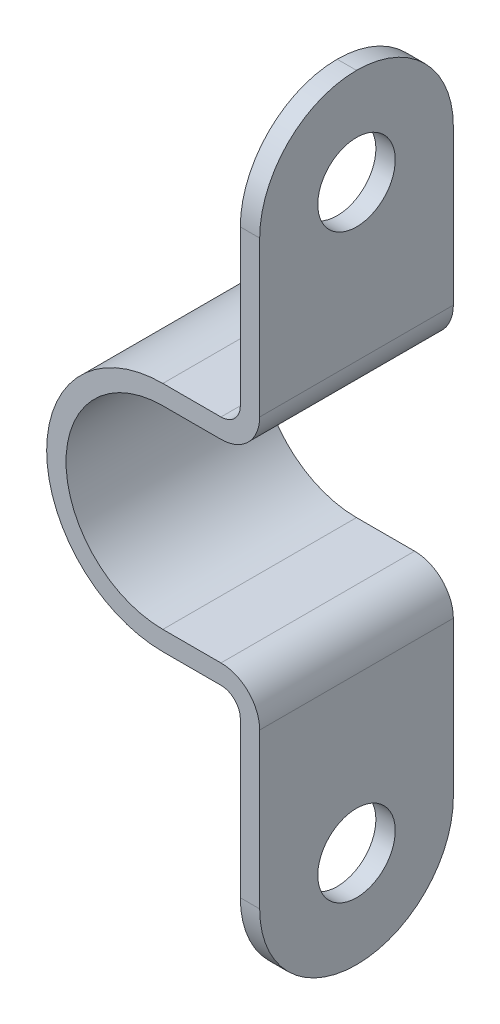
ISO-10303-21;
HEADER;
FILE_DESCRIPTION(('STEP AP214'),'2;1');
FILE_NAME('part.step','',(''),(''),'','','');
FILE_SCHEMA(('AUTOMOTIVE_DESIGN { 1 0 10303 214 1 1 1 1 }'));
ENDSEC;
DATA;
#1=APPLICATION_CONTEXT('core data for automotive mechanical design processes');
#2=APPLICATION_PROTOCOL_DEFINITION('international standard','automotive_design',2000,#1);
#3=PRODUCT_CONTEXT('',#1,'mechanical');
#4=PRODUCT('Part','Part','',(#3));
#5=PRODUCT_RELATED_PRODUCT_CATEGORY('part','',(#4));
#6=PRODUCT_DEFINITION_FORMATION('','',#4);
#7=PRODUCT_DEFINITION_CONTEXT('part definition',#1,'design');
#8=PRODUCT_DEFINITION('design','',#6,#7);
#9=PRODUCT_DEFINITION_SHAPE('','',#8);
#10=(LENGTH_UNIT() NAMED_UNIT(*) SI_UNIT(.MILLI.,.METRE.));
#11=(NAMED_UNIT(*) PLANE_ANGLE_UNIT() SI_UNIT($,.RADIAN.));
#12=(NAMED_UNIT(*) SI_UNIT($,.STERADIAN.) SOLID_ANGLE_UNIT());
#13=UNCERTAINTY_MEASURE_WITH_UNIT(LENGTH_MEASURE(1.E-05),#10,'distance_accuracy_value','');
#14=(GEOMETRIC_REPRESENTATION_CONTEXT(3) GLOBAL_UNCERTAINTY_ASSIGNED_CONTEXT((#13)) GLOBAL_UNIT_ASSIGNED_CONTEXT((#10,
#11,#12)) REPRESENTATION_CONTEXT('',''));
#15=CARTESIAN_POINT('',(0.,0.,0.));
#16=DIRECTION('',(0.,0.,1.));
#17=DIRECTION('',(1.,0.,0.));
#18=AXIS2_PLACEMENT_3D('',#15,#16,#17);
#19=CARTESIAN_POINT('',(4.,-7.00000000000002,10.));
#20=DIRECTION('',(1.,0.,0.));
#21=DIRECTION('',(0.,1.,0.));
#22=AXIS2_PLACEMENT_3D('',#19,#20,#21);
#23=PLANE('',#22);
#24=CARTESIAN_POINT('',(4.,-15.,5.));
#25=DIRECTION('',(-1.,0.,0.));
#26=DIRECTION('',(0.,-1.,0.));
#27=AXIS2_PLACEMENT_3D('',#24,#25,#26);
#28=CIRCLE('',#27,2.);
#29=CARTESIAN_POINT('',(4.,-17.,5.));
#30=VERTEX_POINT('',#29);
#31=EDGE_CURVE('E300',#30,#30,#28,.T.);
#32=ORIENTED_EDGE('',*,*,#31,.F.);
#33=EDGE_LOOP('',(#32));
#34=FACE_BOUND('',#33,.T.);
#35=CARTESIAN_POINT('',(4.,-15.,5.));
#36=DIRECTION('',(1.,0.,0.));
#37=DIRECTION('',(0.,1.,0.));
#38=AXIS2_PLACEMENT_3D('',#35,#36,#37);
#39=CIRCLE('',#38,5.);
#40=CARTESIAN_POINT('',(4.,-15.,0.));
#41=VERTEX_POINT('',#40);
#42=CARTESIAN_POINT('',(4.,-20.,5.));
#43=VERTEX_POINT('',#42);
#44=EDGE_CURVE('E57',#41,#43,#39,.F.);
#45=ORIENTED_EDGE('',*,*,#44,.T.);
#46=CARTESIAN_POINT('',(4.,-15.,5.));
#47=DIRECTION('',(1.,0.,0.));
#48=DIRECTION('',(0.,1.,0.));
#49=AXIS2_PLACEMENT_3D('',#46,#47,#48);
#50=CIRCLE('',#49,5.);
#51=CARTESIAN_POINT('',(4.,-15.,10.));
#52=VERTEX_POINT('',#51);
#53=EDGE_CURVE('E289',#43,#52,#50,.F.);
#54=ORIENTED_EDGE('',*,*,#53,.T.);
#55=DIRECTION('',(0.,-1.,0.));
#56=VECTOR('',#55,1.);
#57=CARTESIAN_POINT('',(4.,-7.00000000000002,10.));
#58=LINE('',#57,#56);
#59=CARTESIAN_POINT('',(4.,-7.00000000000002,10.));
#60=VERTEX_POINT('',#59);
#61=EDGE_CURVE('E182',#60,#52,#58,.T.);
#62=ORIENTED_EDGE('',*,*,#61,.F.);
#63=DIRECTION('',(0.,0.,-1.));
#64=VECTOR('',#63,1.);
#65=CARTESIAN_POINT('',(4.,-7.00000000000002,10.));
#66=LINE('',#65,#64);
#67=CARTESIAN_POINT('',(4.,-7.00000000000002,0.));
#68=VERTEX_POINT('',#67);
#69=EDGE_CURVE('E213',#60,#68,#66,.T.);
#70=ORIENTED_EDGE('',*,*,#69,.T.);
#71=DIRECTION('',(0.,-1.,0.));
#72=VECTOR('',#71,1.);
#73=CARTESIAN_POINT('',(4.,-7.00000000000002,0.));
#74=LINE('',#73,#72);
#75=EDGE_CURVE('E214',#68,#41,#74,.T.);
#76=ORIENTED_EDGE('',*,*,#75,.T.);
#77=EDGE_LOOP('',(#45,#54,#62,#70,#76));
#78=FACE_BOUND('',#77,.T.);
#79=ADVANCED_FACE('F34',(#34,#78),#23,.F.);
#80=CARTESIAN_POINT('',(5.,-7.00000000000002,10.));
#81=DIRECTION('',(1.,0.,0.));
#82=DIRECTION('',(0.,1.,0.));
#83=AXIS2_PLACEMENT_3D('',#80,#81,#82);
#84=PLANE('',#83);
#85=CARTESIAN_POINT('',(5.00000000000001,-15.,5.));
#86=DIRECTION('',(-1.,0.,0.));
#87=DIRECTION('',(0.,-1.,0.));
#88=AXIS2_PLACEMENT_3D('',#85,#86,#87);
#89=CIRCLE('',#88,2.);
#90=CARTESIAN_POINT('',(5.00000000000001,-17.,5.));
#91=VERTEX_POINT('',#90);
#92=EDGE_CURVE('E296',#91,#91,#89,.T.);
#93=ORIENTED_EDGE('',*,*,#92,.T.);
#94=EDGE_LOOP('',(#93));
#95=FACE_BOUND('',#94,.T.);
#96=DIRECTION('',(0.,-1.,0.));
#97=VECTOR('',#96,1.);
#98=CARTESIAN_POINT('',(5.,-7.00000000000002,10.));
#99=LINE('',#98,#97);
#100=CARTESIAN_POINT('',(5.,-7.00000000000002,10.));
#101=VERTEX_POINT('',#100);
#102=CARTESIAN_POINT('',(5.,-15.,10.));
#103=VERTEX_POINT('',#102);
#104=EDGE_CURVE('E161',#101,#103,#99,.T.);
#105=ORIENTED_EDGE('',*,*,#104,.T.);
#106=CARTESIAN_POINT('',(5.,-15.,5.));
#107=DIRECTION('',(1.,0.,0.));
#108=DIRECTION('',(0.,1.,0.));
#109=AXIS2_PLACEMENT_3D('',#106,#107,#108);
#110=CIRCLE('',#109,5.);
#111=CARTESIAN_POINT('',(5.,-20.,5.));
#112=VERTEX_POINT('',#111);
#113=EDGE_CURVE('E11',#103,#112,#110,.T.);
#114=ORIENTED_EDGE('',*,*,#113,.T.);
#115=CARTESIAN_POINT('',(5.,-15.,5.));
#116=DIRECTION('',(1.,0.,0.));
#117=DIRECTION('',(0.,1.,0.));
#118=AXIS2_PLACEMENT_3D('',#115,#116,#117);
#119=CIRCLE('',#118,5.);
#120=CARTESIAN_POINT('',(5.,-15.,0.));
#121=VERTEX_POINT('',#120);
#122=EDGE_CURVE('E43',#112,#121,#119,.T.);
#123=ORIENTED_EDGE('',*,*,#122,.T.);
#124=DIRECTION('',(0.,-1.,0.));
#125=VECTOR('',#124,1.);
#126=CARTESIAN_POINT('',(5.,-7.00000000000002,0.));
#127=LINE('',#126,#125);
#128=CARTESIAN_POINT('',(5.,-7.00000000000002,0.));
#129=VERTEX_POINT('',#128);
#130=EDGE_CURVE('E163',#129,#121,#127,.T.);
#131=ORIENTED_EDGE('',*,*,#130,.F.);
#132=DIRECTION('',(0.,0.,-1.));
#133=VECTOR('',#132,1.);
#134=CARTESIAN_POINT('',(5.,-7.00000000000002,10.));
#135=LINE('',#134,#133);
#136=EDGE_CURVE('E158',#101,#129,#135,.T.);
#137=ORIENTED_EDGE('',*,*,#136,.F.);
#138=EDGE_LOOP('',(#105,#114,#123,#131,#137));
#139=FACE_BOUND('',#138,.T.);
#140=ADVANCED_FACE('F160',(#95,#139),#84,.T.);
#141=CARTESIAN_POINT('',(3.,-7.,10.));
#142=DIRECTION('',(0.,0.,-1.));
#143=DIRECTION('',(-1.,0.,0.));
#144=AXIS2_PLACEMENT_3D('',#141,#142,#143);
#145=CYLINDRICAL_SURFACE('',#144,2.);
#146=CARTESIAN_POINT('',(3.,-7.,0.));
#147=DIRECTION('',(0.,0.,-1.));
#148=DIRECTION('',(1.,0.,0.));
#149=AXIS2_PLACEMENT_3D('',#146,#147,#148);
#150=CIRCLE('',#149,2.);
#151=CARTESIAN_POINT('',(2.99999999999999,-5.,0.));
#152=VERTEX_POINT('',#151);
#153=EDGE_CURVE('E218',#152,#129,#150,.T.);
#154=ORIENTED_EDGE('',*,*,#153,.F.);
#155=DIRECTION('',(0.,0.,-1.));
#156=VECTOR('',#155,1.);
#157=CARTESIAN_POINT('',(2.99999999999999,-5.,10.));
#158=LINE('',#157,#156);
#159=CARTESIAN_POINT('',(2.99999999999999,-5.,10.));
#160=VERTEX_POINT('',#159);
#161=EDGE_CURVE('E169',#160,#152,#158,.T.);
#162=ORIENTED_EDGE('',*,*,#161,.F.);
#163=CARTESIAN_POINT('',(3.,-7.,10.));
#164=DIRECTION('',(0.,0.,-1.));
#165=DIRECTION('',(1.,0.,0.));
#166=AXIS2_PLACEMENT_3D('',#163,#164,#165);
#167=CIRCLE('',#166,2.);
#168=EDGE_CURVE('E177',#160,#101,#167,.T.);
#169=ORIENTED_EDGE('',*,*,#168,.T.);
#170=ORIENTED_EDGE('',*,*,#136,.T.);
#171=EDGE_LOOP('',(#154,#162,#169,#170));
#172=FACE_BOUND('',#171,.T.);
#173=ADVANCED_FACE('F184',(#172),#145,.T.);
#174=CARTESIAN_POINT('',(0.,-5.,10.));
#175=DIRECTION('',(0.,1.,0.));
#176=DIRECTION('',(0.,0.,1.));
#177=AXIS2_PLACEMENT_3D('',#174,#175,#176);
#178=PLANE('',#177);
#179=DIRECTION('',(1.,0.,0.));
#180=VECTOR('',#179,1.);
#181=CARTESIAN_POINT('',(0.,-5.,0.));
#182=LINE('',#181,#180);
#183=CARTESIAN_POINT('',(0.,-5.,0.));
#184=VERTEX_POINT('',#183);
#185=EDGE_CURVE('E220',#184,#152,#182,.T.);
#186=ORIENTED_EDGE('',*,*,#185,.F.);
#187=DIRECTION('',(0.,0.,-1.));
#188=VECTOR('',#187,1.);
#189=CARTESIAN_POINT('',(0.,-5.,10.));
#190=LINE('',#189,#188);
#191=CARTESIAN_POINT('',(0.,-5.,10.));
#192=VERTEX_POINT('',#191);
#193=EDGE_CURVE('E270',#192,#184,#190,.T.);
#194=ORIENTED_EDGE('',*,*,#193,.F.);
#195=DIRECTION('',(1.,0.,0.));
#196=VECTOR('',#195,1.);
#197=CARTESIAN_POINT('',(0.,-5.,10.));
#198=LINE('',#197,#196);
#199=EDGE_CURVE('E185',#192,#160,#198,.T.);
#200=ORIENTED_EDGE('',*,*,#199,.T.);
#201=ORIENTED_EDGE('',*,*,#161,.T.);
#202=EDGE_LOOP('',(#186,#194,#200,#201));
#203=FACE_BOUND('',#202,.T.);
#204=ADVANCED_FACE('F395',(#203),#178,.T.);
#205=CARTESIAN_POINT('',(0.,0.,10.));
#206=DIRECTION('',(0.,0.,-1.));
#207=DIRECTION('',(-1.,0.,0.));
#208=AXIS2_PLACEMENT_3D('',#205,#206,#207);
#209=CYLINDRICAL_SURFACE('',#208,5.);
#210=CARTESIAN_POINT('',(0.,0.,0.));
#211=DIRECTION('',(0.,0.,1.));
#212=DIRECTION('',(1.,0.,0.));
#213=AXIS2_PLACEMENT_3D('',#210,#211,#212);
#214=CIRCLE('',#213,5.);
#215=CARTESIAN_POINT('',(0.,5.,0.));
#216=VERTEX_POINT('',#215);
#217=EDGE_CURVE('E223',#216,#184,#214,.T.);
#218=ORIENTED_EDGE('',*,*,#217,.F.);
#219=DIRECTION('',(0.,0.,-1.));
#220=VECTOR('',#219,1.);
#221=CARTESIAN_POINT('',(0.,5.,10.));
#222=LINE('',#221,#220);
#223=CARTESIAN_POINT('',(0.,5.,10.));
#224=VERTEX_POINT('',#223);
#225=EDGE_CURVE('E268',#224,#216,#222,.T.);
#226=ORIENTED_EDGE('',*,*,#225,.F.);
#227=CARTESIAN_POINT('',(0.,0.,10.));
#228=DIRECTION('',(0.,0.,1.));
#229=DIRECTION('',(1.,0.,0.));
#230=AXIS2_PLACEMENT_3D('',#227,#228,#229);
#231=CIRCLE('',#230,5.);
#232=EDGE_CURVE('E187',#224,#192,#231,.T.);
#233=ORIENTED_EDGE('',*,*,#232,.T.);
#234=ORIENTED_EDGE('',*,*,#193,.T.);
#235=EDGE_LOOP('',(#218,#226,#233,#234));
#236=FACE_BOUND('',#235,.T.);
#237=ADVANCED_FACE('F392',(#236),#209,.F.);
#238=CARTESIAN_POINT('',(0.,5.,10.));
#239=DIRECTION('',(0.,-1.,0.));
#240=DIRECTION('',(0.,0.,-1.));
#241=AXIS2_PLACEMENT_3D('',#238,#239,#240);
#242=PLANE('',#241);
#243=DIRECTION('',(-1.,0.,0.));
#244=VECTOR('',#243,1.);
#245=CARTESIAN_POINT('',(0.,5.,0.));
#246=LINE('',#245,#244);
#247=CARTESIAN_POINT('',(2.99999999999999,5.,0.));
#248=VERTEX_POINT('',#247);
#249=EDGE_CURVE('E226',#248,#216,#246,.T.);
#250=ORIENTED_EDGE('',*,*,#249,.F.);
#251=DIRECTION('',(0.,0.,-1.));
#252=VECTOR('',#251,1.);
#253=CARTESIAN_POINT('',(2.99999999999999,5.,10.));
#254=LINE('',#253,#252);
#255=CARTESIAN_POINT('',(2.99999999999999,5.,10.));
#256=VERTEX_POINT('',#255);
#257=EDGE_CURVE('E266',#256,#248,#254,.T.);
#258=ORIENTED_EDGE('',*,*,#257,.F.);
#259=DIRECTION('',(-1.,0.,0.));
#260=VECTOR('',#259,1.);
#261=CARTESIAN_POINT('',(0.,5.,10.));
#262=LINE('',#261,#260);
#263=EDGE_CURVE('E193',#256,#224,#262,.T.);
#264=ORIENTED_EDGE('',*,*,#263,.T.);
#265=ORIENTED_EDGE('',*,*,#225,.T.);
#266=EDGE_LOOP('',(#250,#258,#264,#265));
#267=FACE_BOUND('',#266,.T.);
#268=ADVANCED_FACE('F388',(#267),#242,.T.);
#269=CARTESIAN_POINT('',(3.,7.,10.));
#270=DIRECTION('',(0.,0.,-1.));
#271=DIRECTION('',(-1.,0.,0.));
#272=AXIS2_PLACEMENT_3D('',#269,#270,#271);
#273=CYLINDRICAL_SURFACE('',#272,2.);
#274=CARTESIAN_POINT('',(3.,7.,0.));
#275=DIRECTION('',(0.,0.,-1.));
#276=DIRECTION('',(1.,0.,0.));
#277=AXIS2_PLACEMENT_3D('',#274,#275,#276);
#278=CIRCLE('',#277,2.);
#279=CARTESIAN_POINT('',(5.,7.00000000000002,0.));
#280=VERTEX_POINT('',#279);
#281=EDGE_CURVE('E229',#280,#248,#278,.T.);
#282=ORIENTED_EDGE('',*,*,#281,.F.);
#283=DIRECTION('',(0.,0.,-1.));
#284=VECTOR('',#283,1.);
#285=CARTESIAN_POINT('',(5.,7.00000000000002,10.));
#286=LINE('',#285,#284);
#287=CARTESIAN_POINT('',(5.,7.00000000000002,10.));
#288=VERTEX_POINT('',#287);
#289=EDGE_CURVE('E263',#288,#280,#286,.T.);
#290=ORIENTED_EDGE('',*,*,#289,.F.);
#291=CARTESIAN_POINT('',(3.,7.,10.));
#292=DIRECTION('',(0.,0.,-1.));
#293=DIRECTION('',(1.,0.,0.));
#294=AXIS2_PLACEMENT_3D('',#291,#292,#293);
#295=CIRCLE('',#294,2.);
#296=EDGE_CURVE('E196',#288,#256,#295,.T.);
#297=ORIENTED_EDGE('',*,*,#296,.T.);
#298=ORIENTED_EDGE('',*,*,#257,.T.);
#299=EDGE_LOOP('',(#282,#290,#297,#298));
#300=FACE_BOUND('',#299,.T.);
#301=ADVANCED_FACE('F384',(#300),#273,.T.);
#302=CARTESIAN_POINT('',(5.,7.00000000000002,10.));
#303=DIRECTION('',(1.,0.,0.));
#304=DIRECTION('',(0.,1.,0.));
#305=AXIS2_PLACEMENT_3D('',#302,#303,#304);
#306=PLANE('',#305);
#307=CARTESIAN_POINT('',(5.,15.,5.));
#308=DIRECTION('',(-1.,0.,0.));
#309=DIRECTION('',(0.,-1.,0.));
#310=AXIS2_PLACEMENT_3D('',#307,#308,#309);
#311=CIRCLE('',#310,2.);
#312=CARTESIAN_POINT('',(5.,13.,5.));
#313=VERTEX_POINT('',#312);
#314=EDGE_CURVE('E305',#313,#313,#311,.T.);
#315=ORIENTED_EDGE('',*,*,#314,.T.);
#316=EDGE_LOOP('',(#315));
#317=FACE_BOUND('',#316,.T.);
#318=CARTESIAN_POINT('',(5.,15.,5.));
#319=DIRECTION('',(1.,0.,0.));
#320=DIRECTION('',(0.,1.,0.));
#321=AXIS2_PLACEMENT_3D('',#318,#319,#320);
#322=CIRCLE('',#321,5.);
#323=CARTESIAN_POINT('',(5.,15.,0.));
#324=VERTEX_POINT('',#323);
#325=CARTESIAN_POINT('',(5.,20.,5.));
#326=VERTEX_POINT('',#325);
#327=EDGE_CURVE('E168',#324,#326,#322,.T.);
#328=ORIENTED_EDGE('',*,*,#327,.T.);
#329=CARTESIAN_POINT('',(5.,15.,5.));
#330=DIRECTION('',(1.,0.,0.));
#331=DIRECTION('',(0.,1.,0.));
#332=AXIS2_PLACEMENT_3D('',#329,#330,#331);
#333=CIRCLE('',#332,5.);
#334=CARTESIAN_POINT('',(5.,15.,10.));
#335=VERTEX_POINT('',#334);
#336=EDGE_CURVE('E274',#326,#335,#333,.T.);
#337=ORIENTED_EDGE('',*,*,#336,.T.);
#338=DIRECTION('',(0.,-1.,0.));
#339=VECTOR('',#338,1.);
#340=CARTESIAN_POINT('',(5.,7.00000000000002,10.));
#341=LINE('',#340,#339);
#342=EDGE_CURVE('E199',#335,#288,#341,.T.);
#343=ORIENTED_EDGE('',*,*,#342,.T.);
#344=ORIENTED_EDGE('',*,*,#289,.T.);
#345=DIRECTION('',(0.,-1.,0.));
#346=VECTOR('',#345,1.);
#347=CARTESIAN_POINT('',(5.,7.00000000000002,0.));
#348=LINE('',#347,#346);
#349=EDGE_CURVE('E232',#324,#280,#348,.T.);
#350=ORIENTED_EDGE('',*,*,#349,.F.);
#351=EDGE_LOOP('',(#328,#337,#343,#344,#350));
#352=FACE_BOUND('',#351,.T.);
#353=ADVANCED_FACE('F379',(#317,#352),#306,.T.);
#354=CARTESIAN_POINT('',(4.,7.00000000000002,10.));
#355=DIRECTION('',(1.,0.,0.));
#356=DIRECTION('',(0.,1.,0.));
#357=AXIS2_PLACEMENT_3D('',#354,#355,#356);
#358=PLANE('',#357);
#359=CARTESIAN_POINT('',(4.,15.,5.));
#360=DIRECTION('',(-1.,0.,0.));
#361=DIRECTION('',(0.,-1.,0.));
#362=AXIS2_PLACEMENT_3D('',#359,#360,#361);
#363=CIRCLE('',#362,2.);
#364=CARTESIAN_POINT('',(4.,13.,5.));
#365=VERTEX_POINT('',#364);
#366=EDGE_CURVE('E308',#365,#365,#363,.T.);
#367=ORIENTED_EDGE('',*,*,#366,.F.);
#368=EDGE_LOOP('',(#367));
#369=FACE_BOUND('',#368,.T.);
#370=DIRECTION('',(0.,-1.,0.));
#371=VECTOR('',#370,1.);
#372=CARTESIAN_POINT('',(4.,7.00000000000002,10.));
#373=LINE('',#372,#371);
#374=CARTESIAN_POINT('',(4.,15.,10.));
#375=VERTEX_POINT('',#374);
#376=CARTESIAN_POINT('',(4.,7.00000000000001,10.));
#377=VERTEX_POINT('',#376);
#378=EDGE_CURVE('E201',#375,#377,#373,.T.);
#379=ORIENTED_EDGE('',*,*,#378,.F.);
#380=CARTESIAN_POINT('',(4.,15.,5.));
#381=DIRECTION('',(1.,0.,0.));
#382=DIRECTION('',(0.,1.,0.));
#383=AXIS2_PLACEMENT_3D('',#380,#381,#382);
#384=CIRCLE('',#383,5.);
#385=CARTESIAN_POINT('',(4.,20.,5.));
#386=VERTEX_POINT('',#385);
#387=EDGE_CURVE('E282',#375,#386,#384,.F.);
#388=ORIENTED_EDGE('',*,*,#387,.T.);
#389=CARTESIAN_POINT('',(4.,15.,5.));
#390=DIRECTION('',(1.,0.,0.));
#391=DIRECTION('',(0.,1.,0.));
#392=AXIS2_PLACEMENT_3D('',#389,#390,#391);
#393=CIRCLE('',#392,5.);
#394=CARTESIAN_POINT('',(4.,15.,0.));
#395=VERTEX_POINT('',#394);
#396=EDGE_CURVE('E280',#386,#395,#393,.F.);
#397=ORIENTED_EDGE('',*,*,#396,.T.);
#398=DIRECTION('',(0.,-1.,0.));
#399=VECTOR('',#398,1.);
#400=CARTESIAN_POINT('',(4.,7.00000000000002,0.));
#401=LINE('',#400,#399);
#402=CARTESIAN_POINT('',(4.,7.00000000000001,0.));
#403=VERTEX_POINT('',#402);
#404=EDGE_CURVE('E234',#395,#403,#401,.T.);
#405=ORIENTED_EDGE('',*,*,#404,.T.);
#406=DIRECTION('',(0.,0.,-1.));
#407=VECTOR('',#406,1.);
#408=CARTESIAN_POINT('',(4.,7.00000000000001,10.));
#409=LINE('',#408,#407);
#410=EDGE_CURVE('E260',#377,#403,#409,.T.);
#411=ORIENTED_EDGE('',*,*,#410,.F.);
#412=EDGE_LOOP('',(#379,#388,#397,#405,#411));
#413=FACE_BOUND('',#412,.T.);
#414=ADVANCED_FACE('F374',(#369,#413),#358,.F.);
#415=CARTESIAN_POINT('',(3.,7.,10.));
#416=DIRECTION('',(0.,0.,-1.));
#417=DIRECTION('',(-1.,0.,0.));
#418=AXIS2_PLACEMENT_3D('',#415,#416,#417);
#419=CYLINDRICAL_SURFACE('',#418,1.);
#420=CARTESIAN_POINT('',(3.,7.,0.));
#421=DIRECTION('',(0.,0.,1.));
#422=DIRECTION('',(1.,0.,0.));
#423=AXIS2_PLACEMENT_3D('',#420,#421,#422);
#424=CIRCLE('',#423,1.);
#425=CARTESIAN_POINT('',(2.99999999999999,6.,0.));
#426=VERTEX_POINT('',#425);
#427=EDGE_CURVE('E236',#403,#426,#424,.F.);
#428=ORIENTED_EDGE('',*,*,#427,.T.);
#429=DIRECTION('',(0.,0.,-1.));
#430=VECTOR('',#429,1.);
#431=CARTESIAN_POINT('',(2.99999999999999,6.,10.));
#432=LINE('',#431,#430);
#433=CARTESIAN_POINT('',(2.99999999999999,6.,10.));
#434=VERTEX_POINT('',#433);
#435=EDGE_CURVE('E257',#434,#426,#432,.T.);
#436=ORIENTED_EDGE('',*,*,#435,.F.);
#437=CARTESIAN_POINT('',(3.,7.,10.));
#438=DIRECTION('',(0.,0.,1.));
#439=DIRECTION('',(1.,0.,0.));
#440=AXIS2_PLACEMENT_3D('',#437,#438,#439);
#441=CIRCLE('',#440,1.);
#442=EDGE_CURVE('E203',#377,#434,#441,.F.);
#443=ORIENTED_EDGE('',*,*,#442,.F.);
#444=ORIENTED_EDGE('',*,*,#410,.T.);
#445=EDGE_LOOP('',(#428,#436,#443,#444));
#446=FACE_BOUND('',#445,.T.);
#447=ADVANCED_FACE('F369',(#446),#419,.F.);
#448=CARTESIAN_POINT('',(0.,6.,10.));
#449=DIRECTION('',(0.,-1.,0.));
#450=DIRECTION('',(0.,0.,-1.));
#451=AXIS2_PLACEMENT_3D('',#448,#449,#450);
#452=PLANE('',#451);
#453=DIRECTION('',(1.,0.,0.));
#454=VECTOR('',#453,1.);
#455=CARTESIAN_POINT('',(0.,6.,0.));
#456=LINE('',#455,#454);
#457=CARTESIAN_POINT('',(0.,6.,0.));
#458=VERTEX_POINT('',#457);
#459=EDGE_CURVE('E238',#426,#458,#456,.F.);
#460=ORIENTED_EDGE('',*,*,#459,.T.);
#461=DIRECTION('',(0.,0.,-1.));
#462=VECTOR('',#461,1.);
#463=CARTESIAN_POINT('',(0.,6.,10.));
#464=LINE('',#463,#462);
#465=CARTESIAN_POINT('',(0.,6.,10.));
#466=VERTEX_POINT('',#465);
#467=EDGE_CURVE('E254',#466,#458,#464,.T.);
#468=ORIENTED_EDGE('',*,*,#467,.F.);
#469=DIRECTION('',(1.,0.,0.));
#470=VECTOR('',#469,1.);
#471=CARTESIAN_POINT('',(0.,6.,10.));
#472=LINE('',#471,#470);
#473=EDGE_CURVE('E205',#434,#466,#472,.F.);
#474=ORIENTED_EDGE('',*,*,#473,.F.);
#475=ORIENTED_EDGE('',*,*,#435,.T.);
#476=EDGE_LOOP('',(#460,#468,#474,#475));
#477=FACE_BOUND('',#476,.T.);
#478=ADVANCED_FACE('F364',(#477),#452,.F.);
#479=CARTESIAN_POINT('',(0.,0.,10.));
#480=DIRECTION('',(0.,0.,-1.));
#481=DIRECTION('',(-1.,0.,0.));
#482=AXIS2_PLACEMENT_3D('',#479,#480,#481);
#483=CYLINDRICAL_SURFACE('',#482,6.);
#484=CARTESIAN_POINT('',(0.,0.,0.));
#485=DIRECTION('',(0.,0.,1.));
#486=DIRECTION('',(1.,0.,0.));
#487=AXIS2_PLACEMENT_3D('',#484,#485,#486);
#488=CIRCLE('',#487,6.);
#489=CARTESIAN_POINT('',(0.,-6.,0.));
#490=VERTEX_POINT('',#489);
#491=EDGE_CURVE('E240',#458,#490,#488,.T.);
#492=ORIENTED_EDGE('',*,*,#491,.T.);
#493=DIRECTION('',(0.,0.,-1.));
#494=VECTOR('',#493,1.);
#495=CARTESIAN_POINT('',(0.,-6.,10.));
#496=LINE('',#495,#494);
#497=CARTESIAN_POINT('',(0.,-6.,10.));
#498=VERTEX_POINT('',#497);
#499=EDGE_CURVE('E251',#498,#490,#496,.T.);
#500=ORIENTED_EDGE('',*,*,#499,.F.);
#501=CARTESIAN_POINT('',(0.,0.,10.));
#502=DIRECTION('',(0.,0.,1.));
#503=DIRECTION('',(1.,0.,0.));
#504=AXIS2_PLACEMENT_3D('',#501,#502,#503);
#505=CIRCLE('',#504,6.);
#506=EDGE_CURVE('E207',#466,#498,#505,.T.);
#507=ORIENTED_EDGE('',*,*,#506,.F.);
#508=ORIENTED_EDGE('',*,*,#467,.T.);
#509=EDGE_LOOP('',(#492,#500,#507,#508));
#510=FACE_BOUND('',#509,.T.);
#511=ADVANCED_FACE('F360',(#510),#483,.T.);
#512=CARTESIAN_POINT('',(0.,-6.,10.));
#513=DIRECTION('',(0.,1.,0.));
#514=DIRECTION('',(0.,0.,1.));
#515=AXIS2_PLACEMENT_3D('',#512,#513,#514);
#516=PLANE('',#515);
#517=DIRECTION('',(1.,0.,0.));
#518=VECTOR('',#517,1.);
#519=CARTESIAN_POINT('',(0.,-6.,0.));
#520=LINE('',#519,#518);
#521=CARTESIAN_POINT('',(2.99999999999999,-6.,0.));
#522=VERTEX_POINT('',#521);
#523=EDGE_CURVE('E242',#490,#522,#520,.T.);
#524=ORIENTED_EDGE('',*,*,#523,.T.);
#525=DIRECTION('',(0.,0.,-1.));
#526=VECTOR('',#525,1.);
#527=CARTESIAN_POINT('',(2.99999999999999,-6.,10.));
#528=LINE('',#527,#526);
#529=CARTESIAN_POINT('',(2.99999999999999,-6.,10.));
#530=VERTEX_POINT('',#529);
#531=EDGE_CURVE('E248',#530,#522,#528,.T.);
#532=ORIENTED_EDGE('',*,*,#531,.F.);
#533=DIRECTION('',(1.,0.,0.));
#534=VECTOR('',#533,1.);
#535=CARTESIAN_POINT('',(0.,-6.,10.));
#536=LINE('',#535,#534);
#537=EDGE_CURVE('E209',#498,#530,#536,.T.);
#538=ORIENTED_EDGE('',*,*,#537,.F.);
#539=ORIENTED_EDGE('',*,*,#499,.T.);
#540=EDGE_LOOP('',(#524,#532,#538,#539));
#541=FACE_BOUND('',#540,.T.);
#542=ADVANCED_FACE('F355',(#541),#516,.F.);
#543=CARTESIAN_POINT('',(3.,-7.,10.));
#544=DIRECTION('',(0.,0.,-1.));
#545=DIRECTION('',(-1.,0.,0.));
#546=AXIS2_PLACEMENT_3D('',#543,#544,#545);
#547=CYLINDRICAL_SURFACE('',#546,1.);
#548=CARTESIAN_POINT('',(3.,-7.,0.));
#549=DIRECTION('',(0.,0.,1.));
#550=DIRECTION('',(1.,0.,0.));
#551=AXIS2_PLACEMENT_3D('',#548,#549,#550);
#552=CIRCLE('',#551,1.);
#553=EDGE_CURVE('E244',#522,#68,#552,.F.);
#554=ORIENTED_EDGE('',*,*,#553,.T.);
#555=ORIENTED_EDGE('',*,*,#69,.F.);
#556=CARTESIAN_POINT('',(3.,-7.,10.));
#557=DIRECTION('',(0.,0.,1.));
#558=DIRECTION('',(1.,0.,0.));
#559=AXIS2_PLACEMENT_3D('',#556,#557,#558);
#560=CIRCLE('',#559,1.);
#561=EDGE_CURVE('E211',#530,#60,#560,.F.);
#562=ORIENTED_EDGE('',*,*,#561,.F.);
#563=ORIENTED_EDGE('',*,*,#531,.T.);
#564=EDGE_LOOP('',(#554,#555,#562,#563));
#565=FACE_BOUND('',#564,.T.);
#566=ADVANCED_FACE('F349',(#565),#547,.F.);
#567=CARTESIAN_POINT('',(3.,-7.,10.));
#568=DIRECTION('',(0.,0.,-1.));
#569=DIRECTION('',(-1.,0.,0.));
#570=AXIS2_PLACEMENT_3D('',#567,#568,#569);
#571=PLANE('',#570);
#572=ORIENTED_EDGE('',*,*,#342,.F.);
#573=DIRECTION('',(1.,0.,0.));
#574=VECTOR('',#573,1.);
#575=CARTESIAN_POINT('',(4.,15.,10.));
#576=LINE('',#575,#574);
#577=EDGE_CURVE('E277',#335,#375,#576,.F.);
#578=ORIENTED_EDGE('',*,*,#577,.T.);
#579=ORIENTED_EDGE('',*,*,#378,.T.);
#580=ORIENTED_EDGE('',*,*,#442,.T.);
#581=ORIENTED_EDGE('',*,*,#473,.T.);
#582=ORIENTED_EDGE('',*,*,#506,.T.);
#583=ORIENTED_EDGE('',*,*,#537,.T.);
#584=ORIENTED_EDGE('',*,*,#561,.T.);
#585=ORIENTED_EDGE('',*,*,#61,.T.);
#586=DIRECTION('',(-1.,0.,0.));
#587=VECTOR('',#586,1.);
#588=CARTESIAN_POINT('',(5.,-15.,10.));
#589=LINE('',#588,#587);
#590=EDGE_CURVE('E181',#52,#103,#589,.F.);
#591=ORIENTED_EDGE('',*,*,#590,.T.);
#592=ORIENTED_EDGE('',*,*,#104,.F.);
#593=ORIENTED_EDGE('',*,*,#168,.F.);
#594=ORIENTED_EDGE('',*,*,#199,.F.);
#595=ORIENTED_EDGE('',*,*,#232,.F.);
#596=ORIENTED_EDGE('',*,*,#263,.F.);
#597=ORIENTED_EDGE('',*,*,#296,.F.);
#598=EDGE_LOOP('',(#572,#578,#579,#580,#581,#582,#583,#584,#585,#591,#592,#593,#594,#595,#596,#597));
#599=FACE_BOUND('',#598,.T.);
#600=ADVANCED_FACE('F175',(#599),#571,.F.);
#601=CARTESIAN_POINT('',(3.,-7.,0.));
#602=DIRECTION('',(0.,0.,-1.));
#603=DIRECTION('',(-1.,0.,0.));
#604=AXIS2_PLACEMENT_3D('',#601,#602,#603);
#605=PLANE('',#604);
#606=ORIENTED_EDGE('',*,*,#404,.F.);
#607=DIRECTION('',(1.,0.,0.));
#608=VECTOR('',#607,1.);
#609=CARTESIAN_POINT('',(3.,15.,0.));
#610=LINE('',#609,#608);
#611=EDGE_CURVE('E286',#395,#324,#610,.T.);
#612=ORIENTED_EDGE('',*,*,#611,.T.);
#613=ORIENTED_EDGE('',*,*,#349,.T.);
#614=ORIENTED_EDGE('',*,*,#281,.T.);
#615=ORIENTED_EDGE('',*,*,#249,.T.);
#616=ORIENTED_EDGE('',*,*,#217,.T.);
#617=ORIENTED_EDGE('',*,*,#185,.T.);
#618=ORIENTED_EDGE('',*,*,#153,.T.);
#619=ORIENTED_EDGE('',*,*,#130,.T.);
#620=DIRECTION('',(-1.,0.,0.));
#621=VECTOR('',#620,1.);
#622=CARTESIAN_POINT('',(3.,-15.,0.));
#623=LINE('',#622,#621);
#624=EDGE_CURVE('E284',#121,#41,#623,.T.);
#625=ORIENTED_EDGE('',*,*,#624,.T.);
#626=ORIENTED_EDGE('',*,*,#75,.F.);
#627=ORIENTED_EDGE('',*,*,#553,.F.);
#628=ORIENTED_EDGE('',*,*,#523,.F.);
#629=ORIENTED_EDGE('',*,*,#491,.F.);
#630=ORIENTED_EDGE('',*,*,#459,.F.);
#631=ORIENTED_EDGE('',*,*,#427,.F.);
#632=EDGE_LOOP('',(#606,#612,#613,#614,#615,#616,#617,#618,#619,#625,#626,#627,#628,#629,#630,#631));
#633=FACE_BOUND('',#632,.T.);
#634=ADVANCED_FACE('F329',(#633),#605,.T.);
#635=CARTESIAN_POINT('',(3.,15.,5.));
#636=DIRECTION('',(1.,0.,0.));
#637=DIRECTION('',(0.,0.,-1.));
#638=AXIS2_PLACEMENT_3D('',#635,#636,#637);
#639=CYLINDRICAL_SURFACE('',#638,5.);
#640=ORIENTED_EDGE('',*,*,#611,.F.);
#641=ORIENTED_EDGE('',*,*,#396,.F.);
#642=DIRECTION('',(1.,0.,0.));
#643=VECTOR('',#642,1.);
#644=CARTESIAN_POINT('',(4.,20.,5.));
#645=LINE('',#644,#643);
#646=EDGE_CURVE('E216',#326,#386,#645,.F.);
#647=ORIENTED_EDGE('',*,*,#646,.F.);
#648=ORIENTED_EDGE('',*,*,#327,.F.);
#649=EDGE_LOOP('',(#640,#641,#647,#648));
#650=FACE_BOUND('',#649,.T.);
#651=ADVANCED_FACE('F327',(#650),#639,.T.);
#652=CARTESIAN_POINT('',(4.,15.,5.));
#653=DIRECTION('',(-1.,0.,0.));
#654=DIRECTION('',(0.,0.,1.));
#655=AXIS2_PLACEMENT_3D('',#652,#653,#654);
#656=CYLINDRICAL_SURFACE('',#655,5.);
#657=ORIENTED_EDGE('',*,*,#387,.F.);
#658=ORIENTED_EDGE('',*,*,#577,.F.);
#659=ORIENTED_EDGE('',*,*,#336,.F.);
#660=ORIENTED_EDGE('',*,*,#646,.T.);
#661=EDGE_LOOP('',(#657,#658,#659,#660));
#662=FACE_BOUND('',#661,.T.);
#663=ADVANCED_FACE('F324',(#662),#656,.T.);
#664=CARTESIAN_POINT('',(3.,-15.,5.));
#665=DIRECTION('',(-1.,0.,0.));
#666=DIRECTION('',(0.,0.,1.));
#667=AXIS2_PLACEMENT_3D('',#664,#665,#666);
#668=CYLINDRICAL_SURFACE('',#667,5.);
#669=ORIENTED_EDGE('',*,*,#624,.F.);
#670=ORIENTED_EDGE('',*,*,#122,.F.);
#671=DIRECTION('',(-1.,0.,0.));
#672=VECTOR('',#671,1.);
#673=CARTESIAN_POINT('',(5.,-20.,5.));
#674=LINE('',#673,#672);
#675=EDGE_CURVE('E38',#43,#112,#674,.F.);
#676=ORIENTED_EDGE('',*,*,#675,.F.);
#677=ORIENTED_EDGE('',*,*,#44,.F.);
#678=EDGE_LOOP('',(#669,#670,#676,#677));
#679=FACE_BOUND('',#678,.T.);
#680=ADVANCED_FACE('F36',(#679),#668,.T.);
#681=CARTESIAN_POINT('',(5.,-15.,5.));
#682=DIRECTION('',(1.,0.,0.));
#683=DIRECTION('',(0.,0.,-1.));
#684=AXIS2_PLACEMENT_3D('',#681,#682,#683);
#685=CYLINDRICAL_SURFACE('',#684,5.);
#686=ORIENTED_EDGE('',*,*,#113,.F.);
#687=ORIENTED_EDGE('',*,*,#590,.F.);
#688=ORIENTED_EDGE('',*,*,#53,.F.);
#689=ORIENTED_EDGE('',*,*,#675,.T.);
#690=EDGE_LOOP('',(#686,#687,#688,#689));
#691=FACE_BOUND('',#690,.T.);
#692=ADVANCED_FACE('F313',(#691),#685,.T.);
#693=CARTESIAN_POINT('',(5.00000000000001,-15.,5.));
#694=DIRECTION('',(-1.,0.,0.));
#695=DIRECTION('',(0.,-1.,0.));
#696=AXIS2_PLACEMENT_3D('',#693,#694,#695);
#697=CYLINDRICAL_SURFACE('',#696,2.);
#698=ORIENTED_EDGE('',*,*,#92,.F.);
#699=EDGE_LOOP('',(#698));
#700=FACE_BOUND('',#699,.T.);
#701=ORIENTED_EDGE('',*,*,#31,.T.);
#702=EDGE_LOOP('',(#701));
#703=FACE_BOUND('',#702,.T.);
#704=ADVANCED_FACE('F332',(#700,#703),#697,.F.);
#705=CARTESIAN_POINT('',(5.,15.,5.));
#706=DIRECTION('',(-1.,0.,0.));
#707=DIRECTION('',(0.,-1.,0.));
#708=AXIS2_PLACEMENT_3D('',#705,#706,#707);
#709=CYLINDRICAL_SURFACE('',#708,2.);
#710=ORIENTED_EDGE('',*,*,#314,.F.);
#711=EDGE_LOOP('',(#710));
#712=FACE_BOUND('',#711,.T.);
#713=ORIENTED_EDGE('',*,*,#366,.T.);
#714=EDGE_LOOP('',(#713));
#715=FACE_BOUND('',#714,.T.);
#716=ADVANCED_FACE('F337',(#712,#715),#709,.F.);
#717=CLOSED_SHELL('',(#79,#140,#173,#204,#237,#268,#301,#353,#414,#447,#478,#511,#542,#566,#600,
#634,#651,#663,#680,#692,#704,#716));
#718=MANIFOLD_SOLID_BREP('B2',#717);
#719=ADVANCED_BREP_SHAPE_REPRESENTATION('',(#18,#718),#14);
#720=SHAPE_DEFINITION_REPRESENTATION(#9,#719);
ENDSEC;
END-ISO-10303-21;
